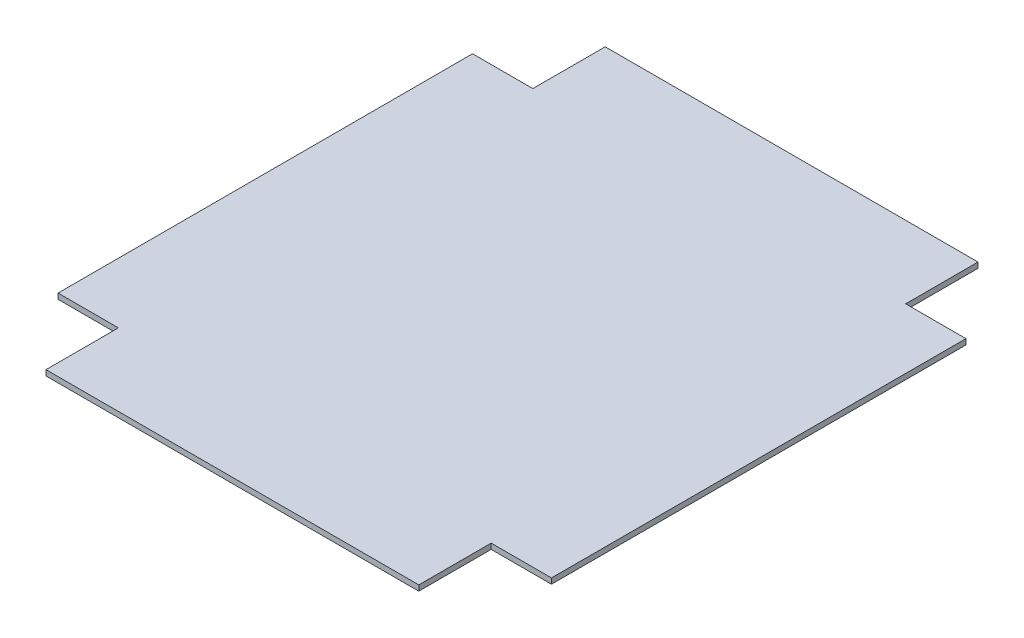
ISO-10303-21;
HEADER;
FILE_DESCRIPTION(('STEP AP214'),'2;1');
FILE_NAME('part.step','',(''),(''),'','','');
FILE_SCHEMA(('AUTOMOTIVE_DESIGN { 1 0 10303 214 1 1 1 1 }'));
ENDSEC;
DATA;
#1=APPLICATION_CONTEXT('core data for automotive mechanical design processes');
#2=APPLICATION_PROTOCOL_DEFINITION('international standard','automotive_design',2000,#1);
#3=PRODUCT_CONTEXT('',#1,'mechanical');
#4=PRODUCT('Part','Part','',(#3));
#5=PRODUCT_RELATED_PRODUCT_CATEGORY('part','',(#4));
#6=PRODUCT_DEFINITION_FORMATION('','',#4);
#7=PRODUCT_DEFINITION_CONTEXT('part definition',#1,'design');
#8=PRODUCT_DEFINITION('design','',#6,#7);
#9=PRODUCT_DEFINITION_SHAPE('','',#8);
#10=(LENGTH_UNIT() NAMED_UNIT(*) SI_UNIT(.MILLI.,.METRE.));
#11=(NAMED_UNIT(*) PLANE_ANGLE_UNIT() SI_UNIT($,.RADIAN.));
#12=(NAMED_UNIT(*) SI_UNIT($,.STERADIAN.) SOLID_ANGLE_UNIT());
#13=UNCERTAINTY_MEASURE_WITH_UNIT(LENGTH_MEASURE(1.E-05),#10,'distance_accuracy_value','');
#14=(GEOMETRIC_REPRESENTATION_CONTEXT(3) GLOBAL_UNCERTAINTY_ASSIGNED_CONTEXT((#13)) GLOBAL_UNIT_ASSIGNED_CONTEXT((#10,
#11,#12)) REPRESENTATION_CONTEXT('',''));
#15=CARTESIAN_POINT('',(0.,0.,0.));
#16=DIRECTION('',(0.,0.,1.));
#17=DIRECTION('',(1.,0.,0.));
#18=AXIS2_PLACEMENT_3D('',#15,#16,#17);
#19=CARTESIAN_POINT('',(-170.,5.,-255.));
#20=DIRECTION('',(1.,0.,0.));
#21=DIRECTION('',(0.,0.,-1.));
#22=AXIS2_PLACEMENT_3D('',#19,#20,#21);
#23=PLANE('',#22);
#24=DIRECTION('',(0.,0.,1.));
#25=VECTOR('',#24,1.);
#26=CARTESIAN_POINT('',(-170.,0.,-255.));
#27=LINE('',#26,#25);
#28=CARTESIAN_POINT('',(-170.,0.,-255.));
#29=VERTEX_POINT('',#28);
#30=CARTESIAN_POINT('',(-170.,0.,-189.));
#31=VERTEX_POINT('',#30);
#32=EDGE_CURVE('E152',#29,#31,#27,.T.);
#33=ORIENTED_EDGE('',*,*,#32,.T.);
#34=DIRECTION('',(0.,-1.,0.));
#35=VECTOR('',#34,1.);
#36=CARTESIAN_POINT('',(-170.,5.,-189.));
#37=LINE('',#36,#35);
#38=CARTESIAN_POINT('',(-170.,5.,-189.));
#39=VERTEX_POINT('',#38);
#40=EDGE_CURVE('E11',#39,#31,#37,.T.);
#41=ORIENTED_EDGE('',*,*,#40,.F.);
#42=DIRECTION('',(0.,0.,1.));
#43=VECTOR('',#42,1.);
#44=CARTESIAN_POINT('',(-170.,5.,-255.));
#45=LINE('',#44,#43);
#46=CARTESIAN_POINT('',(-170.,5.,-255.));
#47=VERTEX_POINT('',#46);
#48=EDGE_CURVE('E174',#47,#39,#45,.T.);
#49=ORIENTED_EDGE('',*,*,#48,.F.);
#50=DIRECTION('',(0.,-1.,0.));
#51=VECTOR('',#50,1.);
#52=CARTESIAN_POINT('',(-170.,5.,-255.));
#53=LINE('',#52,#51);
#54=EDGE_CURVE('E148',#47,#29,#53,.T.);
#55=ORIENTED_EDGE('',*,*,#54,.T.);
#56=EDGE_LOOP('',(#33,#41,#49,#55));
#57=FACE_BOUND('',#56,.T.);
#58=ADVANCED_FACE('F32',(#57),#23,.F.);
#59=CARTESIAN_POINT('',(-225.,5.,-189.));
#60=DIRECTION('',(0.,0.,1.));
#61=DIRECTION('',(1.,0.,0.));
#62=AXIS2_PLACEMENT_3D('',#59,#60,#61);
#63=PLANE('',#62);
#64=DIRECTION('',(-1.,0.,0.));
#65=VECTOR('',#64,1.);
#66=CARTESIAN_POINT('',(-225.,0.,-189.));
#67=LINE('',#66,#65);
#68=CARTESIAN_POINT('',(-225.,0.,-189.));
#69=VERTEX_POINT('',#68);
#70=EDGE_CURVE('E155',#31,#69,#67,.T.);
#71=ORIENTED_EDGE('',*,*,#70,.T.);
#72=DIRECTION('',(0.,-1.,0.));
#73=VECTOR('',#72,1.);
#74=CARTESIAN_POINT('',(-225.,5.,-189.));
#75=LINE('',#74,#73);
#76=CARTESIAN_POINT('',(-225.,5.,-189.));
#77=VERTEX_POINT('',#76);
#78=EDGE_CURVE('E40',#77,#69,#75,.T.);
#79=ORIENTED_EDGE('',*,*,#78,.F.);
#80=DIRECTION('',(-1.,0.,0.));
#81=VECTOR('',#80,1.);
#82=CARTESIAN_POINT('',(-225.,5.,-189.));
#83=LINE('',#82,#81);
#84=EDGE_CURVE('E103',#39,#77,#83,.T.);
#85=ORIENTED_EDGE('',*,*,#84,.F.);
#86=ORIENTED_EDGE('',*,*,#40,.T.);
#87=EDGE_LOOP('',(#71,#79,#85,#86));
#88=FACE_BOUND('',#87,.T.);
#89=ADVANCED_FACE('F252',(#88),#63,.F.);
#90=CARTESIAN_POINT('',(-225.,5.,-189.));
#91=DIRECTION('',(1.,0.,0.));
#92=DIRECTION('',(0.,0.,-1.));
#93=AXIS2_PLACEMENT_3D('',#90,#91,#92);
#94=PLANE('',#93);
#95=DIRECTION('',(0.,0.,1.));
#96=VECTOR('',#95,1.);
#97=CARTESIAN_POINT('',(-225.,0.,-189.));
#98=LINE('',#97,#96);
#99=CARTESIAN_POINT('',(-225.,0.,189.));
#100=VERTEX_POINT('',#99);
#101=EDGE_CURVE('E157',#69,#100,#98,.T.);
#102=ORIENTED_EDGE('',*,*,#101,.T.);
#103=DIRECTION('',(0.,-1.,0.));
#104=VECTOR('',#103,1.);
#105=CARTESIAN_POINT('',(-225.,5.,189.));
#106=LINE('',#105,#104);
#107=CARTESIAN_POINT('',(-225.,5.,189.));
#108=VERTEX_POINT('',#107);
#109=EDGE_CURVE('E193',#108,#100,#106,.T.);
#110=ORIENTED_EDGE('',*,*,#109,.F.);
#111=DIRECTION('',(0.,0.,1.));
#112=VECTOR('',#111,1.);
#113=CARTESIAN_POINT('',(-225.,5.,-189.));
#114=LINE('',#113,#112);
#115=EDGE_CURVE('E201',#77,#108,#114,.T.);
#116=ORIENTED_EDGE('',*,*,#115,.F.);
#117=ORIENTED_EDGE('',*,*,#78,.T.);
#118=EDGE_LOOP('',(#102,#110,#116,#117));
#119=FACE_BOUND('',#118,.T.);
#120=ADVANCED_FACE('F199',(#119),#94,.F.);
#121=CARTESIAN_POINT('',(-225.,5.,189.));
#122=DIRECTION('',(0.,0.,-1.));
#123=DIRECTION('',(-1.,0.,0.));
#124=AXIS2_PLACEMENT_3D('',#121,#122,#123);
#125=PLANE('',#124);
#126=DIRECTION('',(1.,0.,0.));
#127=VECTOR('',#126,1.);
#128=CARTESIAN_POINT('',(-225.,0.,189.));
#129=LINE('',#128,#127);
#130=CARTESIAN_POINT('',(-170.,0.,189.));
#131=VERTEX_POINT('',#130);
#132=EDGE_CURVE('E159',#100,#131,#129,.T.);
#133=ORIENTED_EDGE('',*,*,#132,.T.);
#134=DIRECTION('',(0.,-1.,0.));
#135=VECTOR('',#134,1.);
#136=CARTESIAN_POINT('',(-170.,5.,189.));
#137=LINE('',#136,#135);
#138=CARTESIAN_POINT('',(-170.,5.,189.));
#139=VERTEX_POINT('',#138);
#140=EDGE_CURVE('E190',#139,#131,#137,.T.);
#141=ORIENTED_EDGE('',*,*,#140,.F.);
#142=DIRECTION('',(1.,0.,0.));
#143=VECTOR('',#142,1.);
#144=CARTESIAN_POINT('',(-225.,5.,189.));
#145=LINE('',#144,#143);
#146=EDGE_CURVE('E219',#108,#139,#145,.T.);
#147=ORIENTED_EDGE('',*,*,#146,.F.);
#148=ORIENTED_EDGE('',*,*,#109,.T.);
#149=EDGE_LOOP('',(#133,#141,#147,#148));
#150=FACE_BOUND('',#149,.T.);
#151=ADVANCED_FACE('F210',(#150),#125,.F.);
#152=CARTESIAN_POINT('',(-170.,5.,255.));
#153=DIRECTION('',(1.,0.,0.));
#154=DIRECTION('',(0.,0.,-1.));
#155=AXIS2_PLACEMENT_3D('',#152,#153,#154);
#156=PLANE('',#155);
#157=DIRECTION('',(0.,0.,1.));
#158=VECTOR('',#157,1.);
#159=CARTESIAN_POINT('',(-170.,0.,255.));
#160=LINE('',#159,#158);
#161=CARTESIAN_POINT('',(-170.,0.,255.));
#162=VERTEX_POINT('',#161);
#163=EDGE_CURVE('E161',#131,#162,#160,.T.);
#164=ORIENTED_EDGE('',*,*,#163,.T.);
#165=DIRECTION('',(0.,-1.,0.));
#166=VECTOR('',#165,1.);
#167=CARTESIAN_POINT('',(-170.,5.,255.));
#168=LINE('',#167,#166);
#169=CARTESIAN_POINT('',(-170.,5.,255.));
#170=VERTEX_POINT('',#169);
#171=EDGE_CURVE('E187',#170,#162,#168,.T.);
#172=ORIENTED_EDGE('',*,*,#171,.F.);
#173=DIRECTION('',(0.,0.,1.));
#174=VECTOR('',#173,1.);
#175=CARTESIAN_POINT('',(-170.,5.,255.));
#176=LINE('',#175,#174);
#177=EDGE_CURVE('E216',#139,#170,#176,.T.);
#178=ORIENTED_EDGE('',*,*,#177,.F.);
#179=ORIENTED_EDGE('',*,*,#140,.T.);
#180=EDGE_LOOP('',(#164,#172,#178,#179));
#181=FACE_BOUND('',#180,.T.);
#182=ADVANCED_FACE('F214',(#181),#156,.F.);
#183=CARTESIAN_POINT('',(-170.,5.,255.));
#184=DIRECTION('',(0.,0.,-1.));
#185=DIRECTION('',(-1.,0.,0.));
#186=AXIS2_PLACEMENT_3D('',#183,#184,#185);
#187=PLANE('',#186);
#188=DIRECTION('',(1.,0.,0.));
#189=VECTOR('',#188,1.);
#190=CARTESIAN_POINT('',(-170.,0.,255.));
#191=LINE('',#190,#189);
#192=CARTESIAN_POINT('',(170.,0.,255.));
#193=VERTEX_POINT('',#192);
#194=EDGE_CURVE('E163',#162,#193,#191,.T.);
#195=ORIENTED_EDGE('',*,*,#194,.T.);
#196=DIRECTION('',(0.,-1.,0.));
#197=VECTOR('',#196,1.);
#198=CARTESIAN_POINT('',(170.,5.,255.));
#199=LINE('',#198,#197);
#200=CARTESIAN_POINT('',(170.,5.,255.));
#201=VERTEX_POINT('',#200);
#202=EDGE_CURVE('E184',#201,#193,#199,.T.);
#203=ORIENTED_EDGE('',*,*,#202,.F.);
#204=DIRECTION('',(1.,0.,0.));
#205=VECTOR('',#204,1.);
#206=CARTESIAN_POINT('',(-170.,5.,255.));
#207=LINE('',#206,#205);
#208=EDGE_CURVE('E218',#170,#201,#207,.T.);
#209=ORIENTED_EDGE('',*,*,#208,.F.);
#210=ORIENTED_EDGE('',*,*,#171,.T.);
#211=EDGE_LOOP('',(#195,#203,#209,#210));
#212=FACE_BOUND('',#211,.T.);
#213=ADVANCED_FACE('F265',(#212),#187,.F.);
#214=CARTESIAN_POINT('',(170.,5.,255.));
#215=DIRECTION('',(-1.,0.,0.));
#216=DIRECTION('',(0.,0.,1.));
#217=AXIS2_PLACEMENT_3D('',#214,#215,#216);
#218=PLANE('',#217);
#219=DIRECTION('',(0.,0.,-1.));
#220=VECTOR('',#219,1.);
#221=CARTESIAN_POINT('',(170.,0.,255.));
#222=LINE('',#221,#220);
#223=CARTESIAN_POINT('',(170.,0.,189.));
#224=VERTEX_POINT('',#223);
#225=EDGE_CURVE('E165',#193,#224,#222,.T.);
#226=ORIENTED_EDGE('',*,*,#225,.T.);
#227=DIRECTION('',(0.,-1.,0.));
#228=VECTOR('',#227,1.);
#229=CARTESIAN_POINT('',(170.,5.,189.));
#230=LINE('',#229,#228);
#231=CARTESIAN_POINT('',(170.,5.,189.));
#232=VERTEX_POINT('',#231);
#233=EDGE_CURVE('E181',#232,#224,#230,.T.);
#234=ORIENTED_EDGE('',*,*,#233,.F.);
#235=DIRECTION('',(0.,0.,-1.));
#236=VECTOR('',#235,1.);
#237=CARTESIAN_POINT('',(170.,5.,255.));
#238=LINE('',#237,#236);
#239=EDGE_CURVE('E221',#201,#232,#238,.T.);
#240=ORIENTED_EDGE('',*,*,#239,.F.);
#241=ORIENTED_EDGE('',*,*,#202,.T.);
#242=EDGE_LOOP('',(#226,#234,#240,#241));
#243=FACE_BOUND('',#242,.T.);
#244=ADVANCED_FACE('F268',(#243),#218,.F.);
#245=CARTESIAN_POINT('',(225.,5.,189.));
#246=DIRECTION('',(0.,0.,-1.));
#247=DIRECTION('',(-1.,0.,0.));
#248=AXIS2_PLACEMENT_3D('',#245,#246,#247);
#249=PLANE('',#248);
#250=DIRECTION('',(1.,0.,0.));
#251=VECTOR('',#250,1.);
#252=CARTESIAN_POINT('',(225.,0.,189.));
#253=LINE('',#252,#251);
#254=CARTESIAN_POINT('',(225.,0.,189.));
#255=VERTEX_POINT('',#254);
#256=EDGE_CURVE('E167',#224,#255,#253,.T.);
#257=ORIENTED_EDGE('',*,*,#256,.T.);
#258=DIRECTION('',(0.,-1.,0.));
#259=VECTOR('',#258,1.);
#260=CARTESIAN_POINT('',(225.,5.,189.));
#261=LINE('',#260,#259);
#262=CARTESIAN_POINT('',(225.,5.,189.));
#263=VERTEX_POINT('',#262);
#264=EDGE_CURVE('E178',#263,#255,#261,.T.);
#265=ORIENTED_EDGE('',*,*,#264,.F.);
#266=DIRECTION('',(1.,0.,0.));
#267=VECTOR('',#266,1.);
#268=CARTESIAN_POINT('',(225.,5.,189.));
#269=LINE('',#268,#267);
#270=EDGE_CURVE('E227',#232,#263,#269,.T.);
#271=ORIENTED_EDGE('',*,*,#270,.F.);
#272=ORIENTED_EDGE('',*,*,#233,.T.);
#273=EDGE_LOOP('',(#257,#265,#271,#272));
#274=FACE_BOUND('',#273,.T.);
#275=ADVANCED_FACE('F233',(#274),#249,.F.);
#276=CARTESIAN_POINT('',(225.,5.,-189.));
#277=DIRECTION('',(-1.,0.,0.));
#278=DIRECTION('',(0.,0.,1.));
#279=AXIS2_PLACEMENT_3D('',#276,#277,#278);
#280=PLANE('',#279);
#281=DIRECTION('',(0.,0.,-1.));
#282=VECTOR('',#281,1.);
#283=CARTESIAN_POINT('',(225.,0.,-189.));
#284=LINE('',#283,#282);
#285=CARTESIAN_POINT('',(225.,0.,-189.));
#286=VERTEX_POINT('',#285);
#287=EDGE_CURVE('E169',#255,#286,#284,.T.);
#288=ORIENTED_EDGE('',*,*,#287,.T.);
#289=DIRECTION('',(0.,-1.,0.));
#290=VECTOR('',#289,1.);
#291=CARTESIAN_POINT('',(225.,5.,-189.));
#292=LINE('',#291,#290);
#293=CARTESIAN_POINT('',(225.,5.,-189.));
#294=VERTEX_POINT('',#293);
#295=EDGE_CURVE('E143',#294,#286,#292,.T.);
#296=ORIENTED_EDGE('',*,*,#295,.F.);
#297=DIRECTION('',(0.,0.,-1.));
#298=VECTOR('',#297,1.);
#299=CARTESIAN_POINT('',(225.,5.,-189.));
#300=LINE('',#299,#298);
#301=EDGE_CURVE('E134',#263,#294,#300,.T.);
#302=ORIENTED_EDGE('',*,*,#301,.F.);
#303=ORIENTED_EDGE('',*,*,#264,.T.);
#304=EDGE_LOOP('',(#288,#296,#302,#303));
#305=FACE_BOUND('',#304,.T.);
#306=ADVANCED_FACE('F237',(#305),#280,.F.);
#307=CARTESIAN_POINT('',(225.,5.,-189.));
#308=DIRECTION('',(0.,0.,1.));
#309=DIRECTION('',(1.,0.,0.));
#310=AXIS2_PLACEMENT_3D('',#307,#308,#309);
#311=PLANE('',#310);
#312=DIRECTION('',(-1.,0.,0.));
#313=VECTOR('',#312,1.);
#314=CARTESIAN_POINT('',(225.,0.,-189.));
#315=LINE('',#314,#313);
#316=CARTESIAN_POINT('',(170.,0.,-189.));
#317=VERTEX_POINT('',#316);
#318=EDGE_CURVE('E142',#286,#317,#315,.T.);
#319=ORIENTED_EDGE('',*,*,#318,.T.);
#320=DIRECTION('',(0.,-1.,0.));
#321=VECTOR('',#320,1.);
#322=CARTESIAN_POINT('',(170.,5.,-189.));
#323=LINE('',#322,#321);
#324=CARTESIAN_POINT('',(170.,5.,-189.));
#325=VERTEX_POINT('',#324);
#326=EDGE_CURVE('E139',#325,#317,#323,.T.);
#327=ORIENTED_EDGE('',*,*,#326,.F.);
#328=DIRECTION('',(-1.,0.,0.));
#329=VECTOR('',#328,1.);
#330=CARTESIAN_POINT('',(225.,5.,-189.));
#331=LINE('',#330,#329);
#332=EDGE_CURVE('E128',#294,#325,#331,.T.);
#333=ORIENTED_EDGE('',*,*,#332,.F.);
#334=ORIENTED_EDGE('',*,*,#295,.T.);
#335=EDGE_LOOP('',(#319,#327,#333,#334));
#336=FACE_BOUND('',#335,.T.);
#337=ADVANCED_FACE('F140',(#336),#311,.F.);
#338=CARTESIAN_POINT('',(170.,5.,-255.));
#339=DIRECTION('',(-1.,0.,0.));
#340=DIRECTION('',(0.,0.,1.));
#341=AXIS2_PLACEMENT_3D('',#338,#339,#340);
#342=PLANE('',#341);
#343=DIRECTION('',(0.,0.,-1.));
#344=VECTOR('',#343,1.);
#345=CARTESIAN_POINT('',(170.,0.,-255.));
#346=LINE('',#345,#344);
#347=CARTESIAN_POINT('',(170.,0.,-255.));
#348=VERTEX_POINT('',#347);
#349=EDGE_CURVE('E89',#317,#348,#346,.T.);
#350=ORIENTED_EDGE('',*,*,#349,.T.);
#351=DIRECTION('',(0.,-1.,0.));
#352=VECTOR('',#351,1.);
#353=CARTESIAN_POINT('',(170.,5.,-255.));
#354=LINE('',#353,#352);
#355=CARTESIAN_POINT('',(170.,5.,-255.));
#356=VERTEX_POINT('',#355);
#357=EDGE_CURVE('E144',#356,#348,#354,.T.);
#358=ORIENTED_EDGE('',*,*,#357,.F.);
#359=DIRECTION('',(0.,0.,-1.));
#360=VECTOR('',#359,1.);
#361=CARTESIAN_POINT('',(170.,5.,-255.));
#362=LINE('',#361,#360);
#363=EDGE_CURVE('E132',#325,#356,#362,.T.);
#364=ORIENTED_EDGE('',*,*,#363,.F.);
#365=ORIENTED_EDGE('',*,*,#326,.T.);
#366=EDGE_LOOP('',(#350,#358,#364,#365));
#367=FACE_BOUND('',#366,.T.);
#368=ADVANCED_FACE('F146',(#367),#342,.F.);
#369=CARTESIAN_POINT('',(-170.,5.,-255.));
#370=DIRECTION('',(0.,0.,1.));
#371=DIRECTION('',(1.,0.,0.));
#372=AXIS2_PLACEMENT_3D('',#369,#370,#371);
#373=PLANE('',#372);
#374=DIRECTION('',(-1.,0.,0.));
#375=VECTOR('',#374,1.);
#376=CARTESIAN_POINT('',(-170.,0.,-255.));
#377=LINE('',#376,#375);
#378=EDGE_CURVE('E95',#348,#29,#377,.T.);
#379=ORIENTED_EDGE('',*,*,#378,.T.);
#380=ORIENTED_EDGE('',*,*,#54,.F.);
#381=DIRECTION('',(-1.,0.,0.));
#382=VECTOR('',#381,1.);
#383=CARTESIAN_POINT('',(-170.,5.,-255.));
#384=LINE('',#383,#382);
#385=EDGE_CURVE('E48',#356,#47,#384,.T.);
#386=ORIENTED_EDGE('',*,*,#385,.F.);
#387=ORIENTED_EDGE('',*,*,#357,.T.);
#388=EDGE_LOOP('',(#379,#380,#386,#387));
#389=FACE_BOUND('',#388,.T.);
#390=ADVANCED_FACE('F241',(#389),#373,.F.);
#391=CARTESIAN_POINT('',(0.,5.,0.));
#392=DIRECTION('',(0.,1.,0.));
#393=DIRECTION('',(0.,0.,1.));
#394=AXIS2_PLACEMENT_3D('',#391,#392,#393);
#395=PLANE('',#394);
#396=ORIENTED_EDGE('',*,*,#48,.T.);
#397=ORIENTED_EDGE('',*,*,#84,.T.);
#398=ORIENTED_EDGE('',*,*,#115,.T.);
#399=ORIENTED_EDGE('',*,*,#146,.T.);
#400=ORIENTED_EDGE('',*,*,#177,.T.);
#401=ORIENTED_EDGE('',*,*,#208,.T.);
#402=ORIENTED_EDGE('',*,*,#239,.T.);
#403=ORIENTED_EDGE('',*,*,#270,.T.);
#404=ORIENTED_EDGE('',*,*,#301,.T.);
#405=ORIENTED_EDGE('',*,*,#332,.T.);
#406=ORIENTED_EDGE('',*,*,#363,.T.);
#407=ORIENTED_EDGE('',*,*,#385,.T.);
#408=EDGE_LOOP('',(#396,#397,#398,#399,#400,#401,#402,#403,#404,#405,#406,#407));
#409=FACE_BOUND('',#408,.T.);
#410=ADVANCED_FACE('F130',(#409),#395,.T.);
#411=CARTESIAN_POINT('',(0.,0.,0.));
#412=DIRECTION('',(0.,1.,0.));
#413=DIRECTION('',(0.,0.,1.));
#414=AXIS2_PLACEMENT_3D('',#411,#412,#413);
#415=PLANE('',#414);
#416=ORIENTED_EDGE('',*,*,#32,.F.);
#417=ORIENTED_EDGE('',*,*,#378,.F.);
#418=ORIENTED_EDGE('',*,*,#349,.F.);
#419=ORIENTED_EDGE('',*,*,#318,.F.);
#420=ORIENTED_EDGE('',*,*,#287,.F.);
#421=ORIENTED_EDGE('',*,*,#256,.F.);
#422=ORIENTED_EDGE('',*,*,#225,.F.);
#423=ORIENTED_EDGE('',*,*,#194,.F.);
#424=ORIENTED_EDGE('',*,*,#163,.F.);
#425=ORIENTED_EDGE('',*,*,#132,.F.);
#426=ORIENTED_EDGE('',*,*,#101,.F.);
#427=ORIENTED_EDGE('',*,*,#70,.F.);
#428=EDGE_LOOP('',(#416,#417,#418,#419,#420,#421,#422,#423,#424,#425,#426,#427));
#429=FACE_BOUND('',#428,.T.);
#430=ADVANCED_FACE('F205',(#429),#415,.F.);
#431=CLOSED_SHELL('',(#58,#89,#120,#151,#182,#213,#244,#275,#306,#337,#368,#390,#410,#430));
#432=MANIFOLD_SOLID_BREP('B2',#431);
#433=ADVANCED_BREP_SHAPE_REPRESENTATION('',(#18,#432),#14);
#434=SHAPE_DEFINITION_REPRESENTATION(#9,#433);
ENDSEC;
END-ISO-10303-21;
